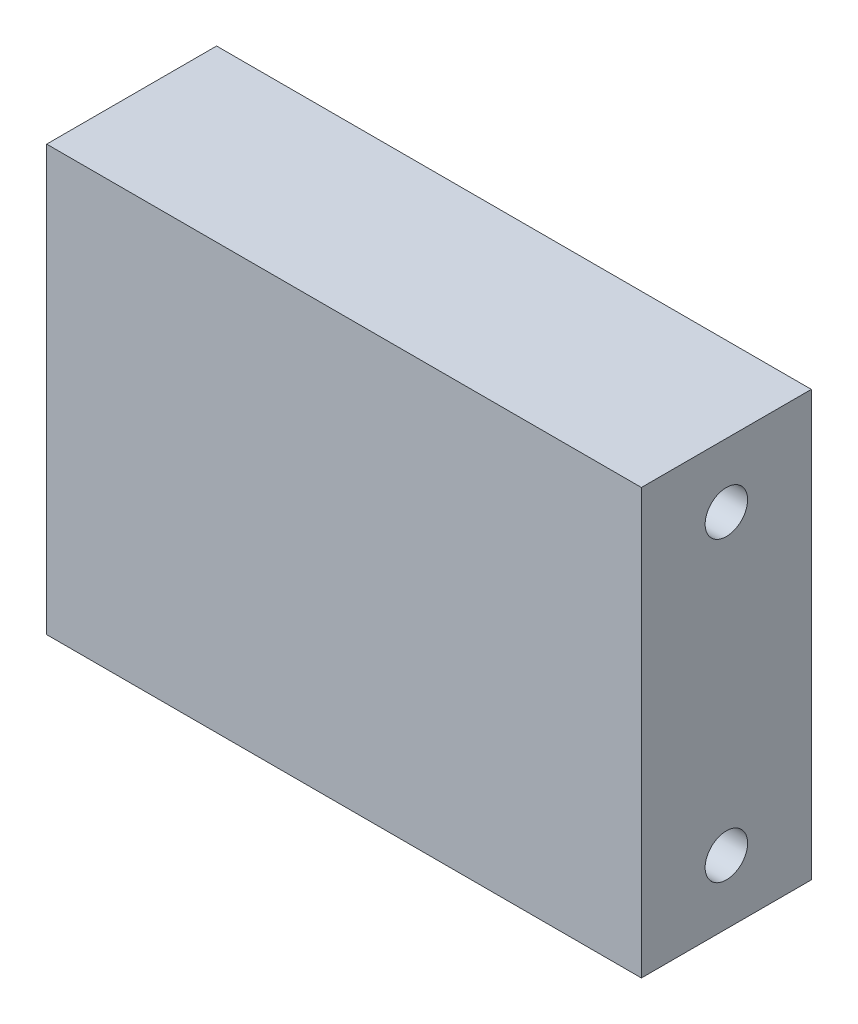
ISO-10303-21;
HEADER;
FILE_DESCRIPTION(('STEP AP214'),'2;1');
FILE_NAME('part.step','',(''),(''),'','','');
FILE_SCHEMA(('AUTOMOTIVE_DESIGN { 1 0 10303 214 1 1 1 1 }'));
ENDSEC;
DATA;
#1=APPLICATION_CONTEXT('core data for automotive mechanical design processes');
#2=APPLICATION_PROTOCOL_DEFINITION('international standard','automotive_design',2000,#1);
#3=PRODUCT_CONTEXT('',#1,'mechanical');
#4=PRODUCT('Part','Part','',(#3));
#5=PRODUCT_RELATED_PRODUCT_CATEGORY('part','',(#4));
#6=PRODUCT_DEFINITION_FORMATION('','',#4);
#7=PRODUCT_DEFINITION_CONTEXT('part definition',#1,'design');
#8=PRODUCT_DEFINITION('design','',#6,#7);
#9=PRODUCT_DEFINITION_SHAPE('','',#8);
#10=(LENGTH_UNIT() NAMED_UNIT(*) SI_UNIT(.MILLI.,.METRE.));
#11=(NAMED_UNIT(*) PLANE_ANGLE_UNIT() SI_UNIT($,.RADIAN.));
#12=(NAMED_UNIT(*) SI_UNIT($,.STERADIAN.) SOLID_ANGLE_UNIT());
#13=UNCERTAINTY_MEASURE_WITH_UNIT(LENGTH_MEASURE(1.E-05),#10,'distance_accuracy_value','');
#14=(GEOMETRIC_REPRESENTATION_CONTEXT(3) GLOBAL_UNCERTAINTY_ASSIGNED_CONTEXT((#13)) GLOBAL_UNIT_ASSIGNED_CONTEXT((#10,
#11,#12)) REPRESENTATION_CONTEXT('',''));
#15=CARTESIAN_POINT('',(0.,0.,0.));
#16=DIRECTION('',(0.,0.,1.));
#17=DIRECTION('',(1.,0.,0.));
#18=AXIS2_PLACEMENT_3D('',#15,#16,#17);
#19=CARTESIAN_POINT('',(0.,127.,0.));
#20=DIRECTION('',(1.,0.,0.));
#21=DIRECTION('',(0.,0.,-1.));
#22=AXIS2_PLACEMENT_3D('',#19,#20,#21);
#23=PLANE('',#22);
#24=CARTESIAN_POINT('',(0.,19.05,-25.4));
#25=DIRECTION('',(-1.,0.,0.));
#26=DIRECTION('',(0.,0.,1.));
#27=AXIS2_PLACEMENT_3D('',#24,#25,#26);
#28=CIRCLE('',#27,6.35);
#29=CARTESIAN_POINT('',(0.,19.05,-19.05));
#30=VERTEX_POINT('',#29);
#31=EDGE_CURVE('E116',#30,#30,#28,.T.);
#32=ORIENTED_EDGE('',*,*,#31,.F.);
#33=EDGE_LOOP('',(#32));
#34=FACE_BOUND('',#33,.T.);
#35=CARTESIAN_POINT('',(0.,107.95,-25.4));
#36=DIRECTION('',(-1.,0.,0.));
#37=DIRECTION('',(0.,0.,-1.));
#38=AXIS2_PLACEMENT_3D('',#35,#36,#37);
#39=CIRCLE('',#38,6.35);
#40=CARTESIAN_POINT('',(0.,107.95,-31.75));
#41=VERTEX_POINT('',#40);
#42=EDGE_CURVE('E110',#41,#41,#39,.T.);
#43=ORIENTED_EDGE('',*,*,#42,.F.);
#44=EDGE_LOOP('',(#43));
#45=FACE_BOUND('',#44,.T.);
#46=DIRECTION('',(0.,0.,1.));
#47=VECTOR('',#46,1.);
#48=CARTESIAN_POINT('',(0.,0.,0.));
#49=LINE('',#48,#47);
#50=CARTESIAN_POINT('',(0.,0.,-50.8));
#51=VERTEX_POINT('',#50);
#52=CARTESIAN_POINT('',(0.,0.,0.));
#53=VERTEX_POINT('',#52);
#54=EDGE_CURVE('E96',#51,#53,#49,.T.);
#55=ORIENTED_EDGE('',*,*,#54,.T.);
#56=DIRECTION('',(0.,-1.,0.));
#57=VECTOR('',#56,1.);
#58=CARTESIAN_POINT('',(0.,127.,0.));
#59=LINE('',#58,#57);
#60=CARTESIAN_POINT('',(0.,127.,0.));
#61=VERTEX_POINT('',#60);
#62=EDGE_CURVE('E11',#61,#53,#59,.T.);
#63=ORIENTED_EDGE('',*,*,#62,.F.);
#64=DIRECTION('',(0.,0.,1.));
#65=VECTOR('',#64,1.);
#66=CARTESIAN_POINT('',(0.,127.,0.));
#67=LINE('',#66,#65);
#68=CARTESIAN_POINT('',(0.,127.,-50.8));
#69=VERTEX_POINT('',#68);
#70=EDGE_CURVE('E84',#69,#61,#67,.T.);
#71=ORIENTED_EDGE('',*,*,#70,.F.);
#72=DIRECTION('',(0.,-1.,0.));
#73=VECTOR('',#72,1.);
#74=CARTESIAN_POINT('',(0.,127.,-50.8));
#75=LINE('',#74,#73);
#76=EDGE_CURVE('E92',#69,#51,#75,.T.);
#77=ORIENTED_EDGE('',*,*,#76,.T.);
#78=EDGE_LOOP('',(#55,#63,#71,#77));
#79=FACE_BOUND('',#78,.T.);
#80=ADVANCED_FACE('F33',(#34,#45,#79),#23,.F.);
#81=CARTESIAN_POINT('',(0.,127.,0.));
#82=DIRECTION('',(0.,0.,-1.));
#83=DIRECTION('',(-1.,0.,0.));
#84=AXIS2_PLACEMENT_3D('',#81,#82,#83);
#85=PLANE('',#84);
#86=DIRECTION('',(1.,0.,0.));
#87=VECTOR('',#86,1.);
#88=CARTESIAN_POINT('',(0.,0.,0.));
#89=LINE('',#88,#87);
#90=CARTESIAN_POINT('',(177.8,0.,0.));
#91=VERTEX_POINT('',#90);
#92=EDGE_CURVE('E88',#53,#91,#89,.T.);
#93=ORIENTED_EDGE('',*,*,#92,.T.);
#94=DIRECTION('',(0.,-1.,0.));
#95=VECTOR('',#94,1.);
#96=CARTESIAN_POINT('',(177.8,127.,0.));
#97=LINE('',#96,#95);
#98=CARTESIAN_POINT('',(177.8,127.,0.));
#99=VERTEX_POINT('',#98);
#100=EDGE_CURVE('E41',#99,#91,#97,.T.);
#101=ORIENTED_EDGE('',*,*,#100,.F.);
#102=DIRECTION('',(1.,0.,0.));
#103=VECTOR('',#102,1.);
#104=CARTESIAN_POINT('',(0.,127.,0.));
#105=LINE('',#104,#103);
#106=EDGE_CURVE('E79',#61,#99,#105,.T.);
#107=ORIENTED_EDGE('',*,*,#106,.F.);
#108=ORIENTED_EDGE('',*,*,#62,.T.);
#109=EDGE_LOOP('',(#93,#101,#107,#108));
#110=FACE_BOUND('',#109,.T.);
#111=ADVANCED_FACE('F87',(#110),#85,.F.);
#112=CARTESIAN_POINT('',(177.8,127.,0.));
#113=DIRECTION('',(-1.,0.,0.));
#114=DIRECTION('',(0.,0.,1.));
#115=AXIS2_PLACEMENT_3D('',#112,#113,#114);
#116=PLANE('',#115);
#117=CARTESIAN_POINT('',(177.8,19.05,-25.4));
#118=DIRECTION('',(-1.,0.,0.));
#119=DIRECTION('',(0.,0.,1.));
#120=AXIS2_PLACEMENT_3D('',#117,#118,#119);
#121=CIRCLE('',#120,6.35);
#122=CARTESIAN_POINT('',(177.8,19.05,-19.05));
#123=VERTEX_POINT('',#122);
#124=EDGE_CURVE('E99',#123,#123,#121,.T.);
#125=ORIENTED_EDGE('',*,*,#124,.T.);
#126=EDGE_LOOP('',(#125));
#127=FACE_BOUND('',#126,.T.);
#128=CARTESIAN_POINT('',(177.8,107.95,-25.4));
#129=DIRECTION('',(-1.,0.,0.));
#130=DIRECTION('',(0.,0.,-1.));
#131=AXIS2_PLACEMENT_3D('',#128,#129,#130);
#132=CIRCLE('',#131,6.35);
#133=CARTESIAN_POINT('',(177.8,107.95,-31.75));
#134=VERTEX_POINT('',#133);
#135=EDGE_CURVE('E113',#134,#134,#132,.T.);
#136=ORIENTED_EDGE('',*,*,#135,.T.);
#137=EDGE_LOOP('',(#136));
#138=FACE_BOUND('',#137,.T.);
#139=DIRECTION('',(0.,0.,-1.));
#140=VECTOR('',#139,1.);
#141=CARTESIAN_POINT('',(177.8,0.,0.));
#142=LINE('',#141,#140);
#143=CARTESIAN_POINT('',(177.8,0.,-50.8));
#144=VERTEX_POINT('',#143);
#145=EDGE_CURVE('E66',#91,#144,#142,.T.);
#146=ORIENTED_EDGE('',*,*,#145,.T.);
#147=DIRECTION('',(0.,-1.,0.));
#148=VECTOR('',#147,1.);
#149=CARTESIAN_POINT('',(177.8,127.,-50.8));
#150=LINE('',#149,#148);
#151=CARTESIAN_POINT('',(177.8,127.,-50.8));
#152=VERTEX_POINT('',#151);
#153=EDGE_CURVE('E89',#152,#144,#150,.T.);
#154=ORIENTED_EDGE('',*,*,#153,.F.);
#155=DIRECTION('',(0.,0.,-1.));
#156=VECTOR('',#155,1.);
#157=CARTESIAN_POINT('',(177.8,127.,0.));
#158=LINE('',#157,#156);
#159=EDGE_CURVE('E82',#99,#152,#158,.T.);
#160=ORIENTED_EDGE('',*,*,#159,.F.);
#161=ORIENTED_EDGE('',*,*,#100,.T.);
#162=EDGE_LOOP('',(#146,#154,#160,#161));
#163=FACE_BOUND('',#162,.T.);
#164=ADVANCED_FACE('F90',(#127,#138,#163),#116,.F.);
#165=CARTESIAN_POINT('',(0.,127.,-50.8));
#166=DIRECTION('',(0.,0.,1.));
#167=DIRECTION('',(1.,0.,0.));
#168=AXIS2_PLACEMENT_3D('',#165,#166,#167);
#169=PLANE('',#168);
#170=DIRECTION('',(-1.,0.,0.));
#171=VECTOR('',#170,1.);
#172=CARTESIAN_POINT('',(0.,0.,-50.8));
#173=LINE('',#172,#171);
#174=EDGE_CURVE('E72',#144,#51,#173,.T.);
#175=ORIENTED_EDGE('',*,*,#174,.T.);
#176=ORIENTED_EDGE('',*,*,#76,.F.);
#177=DIRECTION('',(-1.,0.,0.));
#178=VECTOR('',#177,1.);
#179=CARTESIAN_POINT('',(0.,127.,-50.8));
#180=LINE('',#179,#178);
#181=EDGE_CURVE('E49',#152,#69,#180,.T.);
#182=ORIENTED_EDGE('',*,*,#181,.F.);
#183=ORIENTED_EDGE('',*,*,#153,.T.);
#184=EDGE_LOOP('',(#175,#176,#182,#183));
#185=FACE_BOUND('',#184,.T.);
#186=ADVANCED_FACE('F104',(#185),#169,.F.);
#187=CARTESIAN_POINT('',(0.,127.,0.));
#188=DIRECTION('',(0.,-1.,0.));
#189=DIRECTION('',(0.,0.,-1.));
#190=AXIS2_PLACEMENT_3D('',#187,#188,#189);
#191=PLANE('',#190);
#192=ORIENTED_EDGE('',*,*,#70,.T.);
#193=ORIENTED_EDGE('',*,*,#106,.T.);
#194=ORIENTED_EDGE('',*,*,#159,.T.);
#195=ORIENTED_EDGE('',*,*,#181,.T.);
#196=EDGE_LOOP('',(#192,#193,#194,#195));
#197=FACE_BOUND('',#196,.T.);
#198=ADVANCED_FACE('F80',(#197),#191,.F.);
#199=CARTESIAN_POINT('',(0.,0.,0.));
#200=DIRECTION('',(0.,-1.,0.));
#201=DIRECTION('',(0.,0.,-1.));
#202=AXIS2_PLACEMENT_3D('',#199,#200,#201);
#203=PLANE('',#202);
#204=ORIENTED_EDGE('',*,*,#54,.F.);
#205=ORIENTED_EDGE('',*,*,#174,.F.);
#206=ORIENTED_EDGE('',*,*,#145,.F.);
#207=ORIENTED_EDGE('',*,*,#92,.F.);
#208=EDGE_LOOP('',(#204,#205,#206,#207));
#209=FACE_BOUND('',#208,.T.);
#210=ADVANCED_FACE('F107',(#209),#203,.T.);
#211=CARTESIAN_POINT('',(177.8,107.95,-25.4));
#212=DIRECTION('',(-1.,0.,0.));
#213=DIRECTION('',(0.,0.,1.));
#214=AXIS2_PLACEMENT_3D('',#211,#212,#213);
#215=CYLINDRICAL_SURFACE('',#214,6.35);
#216=ORIENTED_EDGE('',*,*,#135,.F.);
#217=EDGE_LOOP('',(#216));
#218=FACE_BOUND('',#217,.T.);
#219=ORIENTED_EDGE('',*,*,#42,.T.);
#220=EDGE_LOOP('',(#219));
#221=FACE_BOUND('',#220,.T.);
#222=ADVANCED_FACE('F127',(#218,#221),#215,.F.);
#223=CARTESIAN_POINT('',(177.8,19.05,-25.4));
#224=DIRECTION('',(-1.,0.,0.));
#225=DIRECTION('',(0.,0.,1.));
#226=AXIS2_PLACEMENT_3D('',#223,#224,#225);
#227=CYLINDRICAL_SURFACE('',#226,6.35);
#228=ORIENTED_EDGE('',*,*,#124,.F.);
#229=EDGE_LOOP('',(#228));
#230=FACE_BOUND('',#229,.T.);
#231=ORIENTED_EDGE('',*,*,#31,.T.);
#232=EDGE_LOOP('',(#231));
#233=FACE_BOUND('',#232,.T.);
#234=ADVANCED_FACE('F124',(#230,#233),#227,.F.);
#235=CLOSED_SHELL('',(#80,#111,#164,#186,#198,#210,#222,#234));
#236=MANIFOLD_SOLID_BREP('B2',#235);
#237=ADVANCED_BREP_SHAPE_REPRESENTATION('',(#18,#236),#14);
#238=SHAPE_DEFINITION_REPRESENTATION(#9,#237);
ENDSEC;
END-ISO-10303-21;
